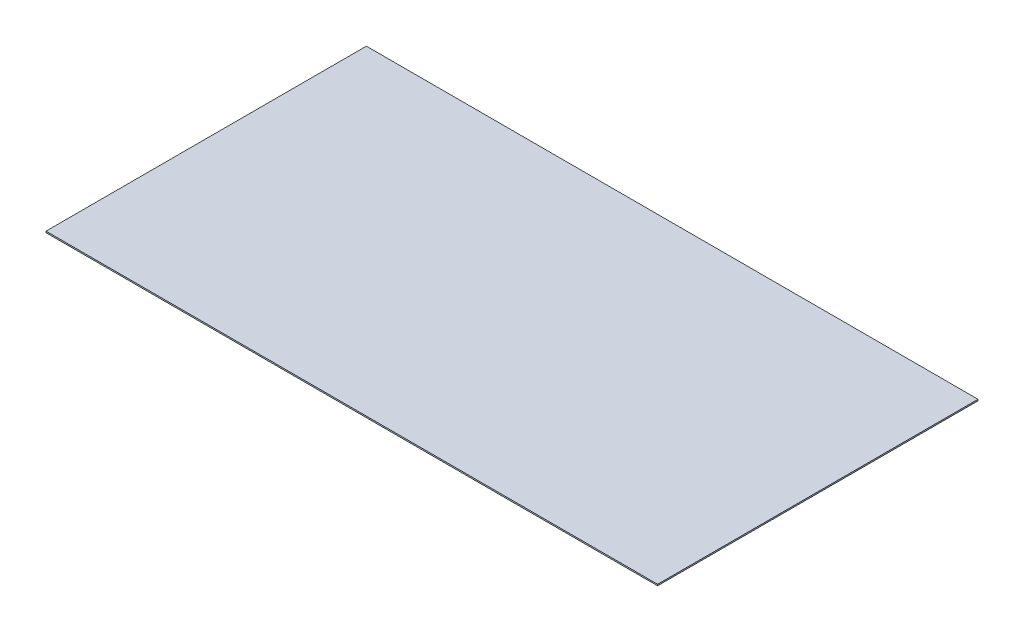
ISO-10303-21;
HEADER;
FILE_DESCRIPTION(('STEP AP214'),'2;1');
FILE_NAME('part.step','',(''),(''),'','','');
FILE_SCHEMA(('AUTOMOTIVE_DESIGN { 1 0 10303 214 1 1 1 1 }'));
ENDSEC;
DATA;
#1=APPLICATION_CONTEXT('core data for automotive mechanical design processes');
#2=APPLICATION_PROTOCOL_DEFINITION('international standard','automotive_design',2000,#1);
#3=PRODUCT_CONTEXT('',#1,'mechanical');
#4=PRODUCT('Part','Part','',(#3));
#5=PRODUCT_RELATED_PRODUCT_CATEGORY('part','',(#4));
#6=PRODUCT_DEFINITION_FORMATION('','',#4);
#7=PRODUCT_DEFINITION_CONTEXT('part definition',#1,'design');
#8=PRODUCT_DEFINITION('design','',#6,#7);
#9=PRODUCT_DEFINITION_SHAPE('','',#8);
#10=(LENGTH_UNIT() NAMED_UNIT(*) SI_UNIT(.MILLI.,.METRE.));
#11=(NAMED_UNIT(*) PLANE_ANGLE_UNIT() SI_UNIT($,.RADIAN.));
#12=(NAMED_UNIT(*) SI_UNIT($,.STERADIAN.) SOLID_ANGLE_UNIT());
#13=UNCERTAINTY_MEASURE_WITH_UNIT(LENGTH_MEASURE(1.E-05),#10,'distance_accuracy_value','');
#14=(GEOMETRIC_REPRESENTATION_CONTEXT(3) GLOBAL_UNCERTAINTY_ASSIGNED_CONTEXT((#13)) GLOBAL_UNIT_ASSIGNED_CONTEXT((#10,
#11,#12)) REPRESENTATION_CONTEXT('',''));
#15=CARTESIAN_POINT('',(0.,0.,0.));
#16=DIRECTION('',(0.,0.,1.));
#17=DIRECTION('',(1.,0.,0.));
#18=AXIS2_PLACEMENT_3D('',#15,#16,#17);
#19=CARTESIAN_POINT('',(1050.,4.7625,-550.));
#20=DIRECTION('',(-1.,0.,0.));
#21=DIRECTION('',(0.,0.,1.));
#22=AXIS2_PLACEMENT_3D('',#19,#20,#21);
#23=PLANE('',#22);
#24=DIRECTION('',(0.,0.,-1.));
#25=VECTOR('',#24,1.);
#26=CARTESIAN_POINT('',(1050.,0.,-550.));
#27=LINE('',#26,#25);
#28=CARTESIAN_POINT('',(1050.,0.,550.));
#29=VERTEX_POINT('',#28);
#30=CARTESIAN_POINT('',(1050.,0.,-550.));
#31=VERTEX_POINT('',#30);
#32=EDGE_CURVE('E99',#29,#31,#27,.T.);
#33=ORIENTED_EDGE('',*,*,#32,.T.);
#34=DIRECTION('',(0.,-1.,0.));
#35=VECTOR('',#34,1.);
#36=CARTESIAN_POINT('',(1050.,4.7625,-550.));
#37=LINE('',#36,#35);
#38=CARTESIAN_POINT('',(1050.,4.7625,-550.));
#39=VERTEX_POINT('',#38);
#40=EDGE_CURVE('E11',#39,#31,#37,.T.);
#41=ORIENTED_EDGE('',*,*,#40,.F.);
#42=DIRECTION('',(0.,0.,-1.));
#43=VECTOR('',#42,1.);
#44=CARTESIAN_POINT('',(1050.,4.7625,-550.));
#45=LINE('',#44,#43);
#46=CARTESIAN_POINT('',(1050.,4.7625,550.));
#47=VERTEX_POINT('',#46);
#48=EDGE_CURVE('E87',#47,#39,#45,.T.);
#49=ORIENTED_EDGE('',*,*,#48,.F.);
#50=DIRECTION('',(0.,-1.,0.));
#51=VECTOR('',#50,1.);
#52=CARTESIAN_POINT('',(1050.,4.7625,550.));
#53=LINE('',#52,#51);
#54=EDGE_CURVE('E95',#47,#29,#53,.T.);
#55=ORIENTED_EDGE('',*,*,#54,.T.);
#56=EDGE_LOOP('',(#33,#41,#49,#55));
#57=FACE_BOUND('',#56,.T.);
#58=ADVANCED_FACE('F36',(#57),#23,.F.);
#59=CARTESIAN_POINT('',(-1050.,4.7625,-550.));
#60=DIRECTION('',(0.,0.,1.));
#61=DIRECTION('',(1.,0.,0.));
#62=AXIS2_PLACEMENT_3D('',#59,#60,#61);
#63=PLANE('',#62);
#64=DIRECTION('',(-1.,0.,0.));
#65=VECTOR('',#64,1.);
#66=CARTESIAN_POINT('',(-1050.,0.,-550.));
#67=LINE('',#66,#65);
#68=CARTESIAN_POINT('',(-1050.,0.,-550.));
#69=VERTEX_POINT('',#68);
#70=EDGE_CURVE('E91',#31,#69,#67,.T.);
#71=ORIENTED_EDGE('',*,*,#70,.T.);
#72=DIRECTION('',(0.,-1.,0.));
#73=VECTOR('',#72,1.);
#74=CARTESIAN_POINT('',(-1050.,4.7625,-550.));
#75=LINE('',#74,#73);
#76=CARTESIAN_POINT('',(-1050.,4.7625,-550.));
#77=VERTEX_POINT('',#76);
#78=EDGE_CURVE('E44',#77,#69,#75,.T.);
#79=ORIENTED_EDGE('',*,*,#78,.F.);
#80=DIRECTION('',(-1.,0.,0.));
#81=VECTOR('',#80,1.);
#82=CARTESIAN_POINT('',(-1050.,4.7625,-550.));
#83=LINE('',#82,#81);
#84=EDGE_CURVE('E82',#39,#77,#83,.T.);
#85=ORIENTED_EDGE('',*,*,#84,.F.);
#86=ORIENTED_EDGE('',*,*,#40,.T.);
#87=EDGE_LOOP('',(#71,#79,#85,#86));
#88=FACE_BOUND('',#87,.T.);
#89=ADVANCED_FACE('F90',(#88),#63,.F.);
#90=CARTESIAN_POINT('',(-1050.,4.7625,-550.));
#91=DIRECTION('',(1.,0.,0.));
#92=DIRECTION('',(0.,0.,-1.));
#93=AXIS2_PLACEMENT_3D('',#90,#91,#92);
#94=PLANE('',#93);
#95=DIRECTION('',(0.,0.,1.));
#96=VECTOR('',#95,1.);
#97=CARTESIAN_POINT('',(-1050.,0.,-550.));
#98=LINE('',#97,#96);
#99=CARTESIAN_POINT('',(-1050.,0.,550.));
#100=VERTEX_POINT('',#99);
#101=EDGE_CURVE('E69',#69,#100,#98,.T.);
#102=ORIENTED_EDGE('',*,*,#101,.T.);
#103=DIRECTION('',(0.,-1.,0.));
#104=VECTOR('',#103,1.);
#105=CARTESIAN_POINT('',(-1050.,4.7625,550.));
#106=LINE('',#105,#104);
#107=CARTESIAN_POINT('',(-1050.,4.7625,550.));
#108=VERTEX_POINT('',#107);
#109=EDGE_CURVE('E92',#108,#100,#106,.T.);
#110=ORIENTED_EDGE('',*,*,#109,.F.);
#111=DIRECTION('',(0.,0.,1.));
#112=VECTOR('',#111,1.);
#113=CARTESIAN_POINT('',(-1050.,4.7625,-550.));
#114=LINE('',#113,#112);
#115=EDGE_CURVE('E85',#77,#108,#114,.T.);
#116=ORIENTED_EDGE('',*,*,#115,.F.);
#117=ORIENTED_EDGE('',*,*,#78,.T.);
#118=EDGE_LOOP('',(#102,#110,#116,#117));
#119=FACE_BOUND('',#118,.T.);
#120=ADVANCED_FACE('F93',(#119),#94,.F.);
#121=CARTESIAN_POINT('',(-1050.,4.7625,550.));
#122=DIRECTION('',(0.,0.,-1.));
#123=DIRECTION('',(-1.,0.,0.));
#124=AXIS2_PLACEMENT_3D('',#121,#122,#123);
#125=PLANE('',#124);
#126=DIRECTION('',(1.,0.,0.));
#127=VECTOR('',#126,1.);
#128=CARTESIAN_POINT('',(-1050.,0.,550.));
#129=LINE('',#128,#127);
#130=EDGE_CURVE('E75',#100,#29,#129,.T.);
#131=ORIENTED_EDGE('',*,*,#130,.T.);
#132=ORIENTED_EDGE('',*,*,#54,.F.);
#133=DIRECTION('',(1.,0.,0.));
#134=VECTOR('',#133,1.);
#135=CARTESIAN_POINT('',(-1050.,4.7625,550.));
#136=LINE('',#135,#134);
#137=EDGE_CURVE('E52',#108,#47,#136,.T.);
#138=ORIENTED_EDGE('',*,*,#137,.F.);
#139=ORIENTED_EDGE('',*,*,#109,.T.);
#140=EDGE_LOOP('',(#131,#132,#138,#139));
#141=FACE_BOUND('',#140,.T.);
#142=ADVANCED_FACE('F106',(#141),#125,.F.);
#143=CARTESIAN_POINT('',(0.,4.7625,0.));
#144=DIRECTION('',(0.,1.,0.));
#145=DIRECTION('',(0.,0.,1.));
#146=AXIS2_PLACEMENT_3D('',#143,#144,#145);
#147=PLANE('',#146);
#148=ORIENTED_EDGE('',*,*,#48,.T.);
#149=ORIENTED_EDGE('',*,*,#84,.T.);
#150=ORIENTED_EDGE('',*,*,#115,.T.);
#151=ORIENTED_EDGE('',*,*,#137,.T.);
#152=EDGE_LOOP('',(#148,#149,#150,#151));
#153=FACE_BOUND('',#152,.T.);
#154=ADVANCED_FACE('F83',(#153),#147,.T.);
#155=CARTESIAN_POINT('',(0.,0.,0.));
#156=DIRECTION('',(0.,1.,0.));
#157=DIRECTION('',(0.,0.,1.));
#158=AXIS2_PLACEMENT_3D('',#155,#156,#157);
#159=PLANE('',#158);
#160=ORIENTED_EDGE('',*,*,#32,.F.);
#161=ORIENTED_EDGE('',*,*,#130,.F.);
#162=ORIENTED_EDGE('',*,*,#101,.F.);
#163=ORIENTED_EDGE('',*,*,#70,.F.);
#164=EDGE_LOOP('',(#160,#161,#162,#163));
#165=FACE_BOUND('',#164,.T.);
#166=ADVANCED_FACE('F109',(#165),#159,.F.);
#167=CLOSED_SHELL('',(#58,#89,#120,#142,#154,#166));
#168=MANIFOLD_SOLID_BREP('B2',#167);
#169=ADVANCED_BREP_SHAPE_REPRESENTATION('',(#18,#168),#14);
#170=SHAPE_DEFINITION_REPRESENTATION(#9,#169);
ENDSEC;
END-ISO-10303-21;
